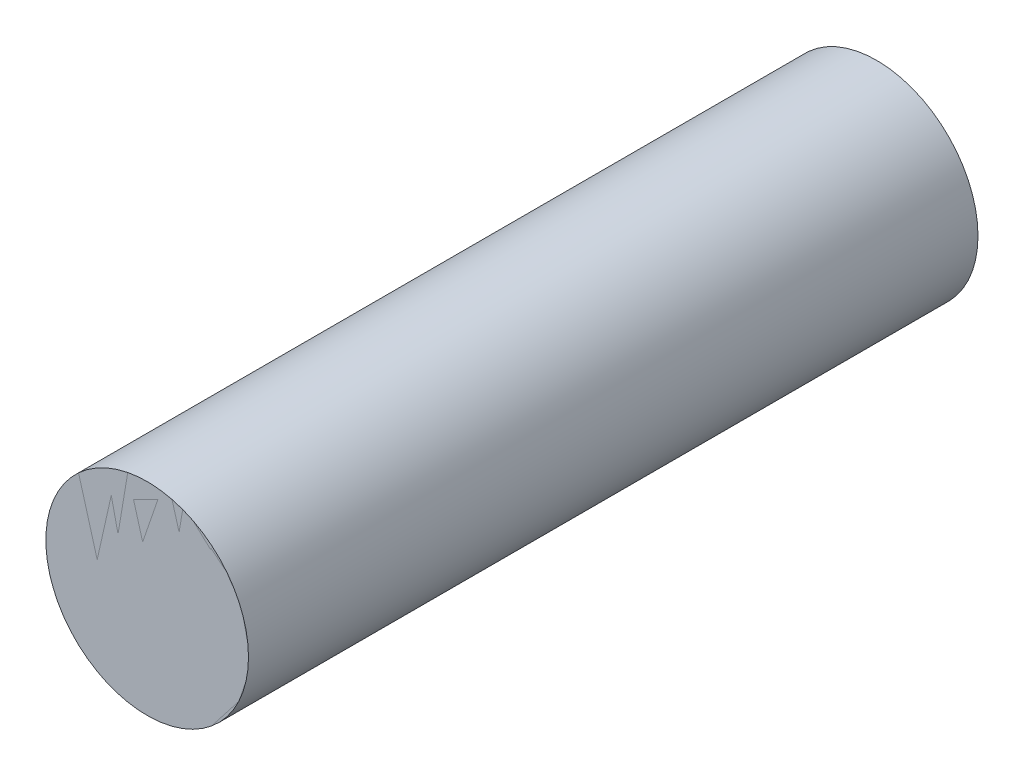
ISO-10303-21;
HEADER;
FILE_DESCRIPTION(('STEP AP214'),'2;1');
FILE_NAME('part.step','',(''),(''),'','','');
FILE_SCHEMA(('AUTOMOTIVE_DESIGN { 1 0 10303 214 1 1 1 1 }'));
ENDSEC;
DATA;
#1=APPLICATION_CONTEXT('core data for automotive mechanical design processes');
#2=APPLICATION_PROTOCOL_DEFINITION('international standard','automotive_design',2000,#1);
#3=PRODUCT_CONTEXT('',#1,'mechanical');
#4=PRODUCT('Part','Part','',(#3));
#5=PRODUCT_RELATED_PRODUCT_CATEGORY('part','',(#4));
#6=PRODUCT_DEFINITION_FORMATION('','',#4);
#7=PRODUCT_DEFINITION_CONTEXT('part definition',#1,'design');
#8=PRODUCT_DEFINITION('design','',#6,#7);
#9=PRODUCT_DEFINITION_SHAPE('','',#8);
#10=(LENGTH_UNIT() NAMED_UNIT(*) SI_UNIT(.MILLI.,.METRE.));
#11=(NAMED_UNIT(*) PLANE_ANGLE_UNIT() SI_UNIT($,.RADIAN.));
#12=(NAMED_UNIT(*) SI_UNIT($,.STERADIAN.) SOLID_ANGLE_UNIT());
#13=UNCERTAINTY_MEASURE_WITH_UNIT(LENGTH_MEASURE(1.E-05),#10,'distance_accuracy_value','');
#14=(GEOMETRIC_REPRESENTATION_CONTEXT(3) GLOBAL_UNCERTAINTY_ASSIGNED_CONTEXT((#13)) GLOBAL_UNIT_ASSIGNED_CONTEXT((#10,
#11,#12)) REPRESENTATION_CONTEXT('',''));
#15=CARTESIAN_POINT('',(0.,0.,0.));
#16=DIRECTION('',(0.,0.,1.));
#17=DIRECTION('',(1.,0.,0.));
#18=AXIS2_PLACEMENT_3D('',#15,#16,#17);
#19=CARTESIAN_POINT('',(-102.183303397109,-56.7521041199526,-7.29999999999987));
#20=DIRECTION('',(0.,0.,1.));
#21=DIRECTION('',(1.,0.,0.));
#22=AXIS2_PLACEMENT_3D('',#19,#20,#21);
#23=CYLINDRICAL_SURFACE('',#22,0.25);
#24=CARTESIAN_POINT('',(-102.183303397109,-56.7521041199526,-7.29999999999987));
#25=DIRECTION('',(0.,0.,1.));
#26=DIRECTION('',(1.,0.,0.));
#27=AXIS2_PLACEMENT_3D('',#24,#25,#26);
#28=CIRCLE('',#27,0.25);
#29=CARTESIAN_POINT('',(-101.933303397109,-56.7521041199526,-7.29999999999987));
#30=VERTEX_POINT('',#29);
#31=EDGE_CURVE('E11',#30,#30,#28,.T.);
#32=ORIENTED_EDGE('',*,*,#31,.T.);
#33=EDGE_LOOP('',(#32));
#34=FACE_BOUND('',#33,.T.);
#35=CARTESIAN_POINT('',(-102.183303397109,-56.7521041199526,-5.49999999999987));
#36=DIRECTION('',(0.,0.,1.));
#37=DIRECTION('',(1.,0.,0.));
#38=AXIS2_PLACEMENT_3D('',#35,#36,#37);
#39=CIRCLE('',#38,0.25);
#40=CARTESIAN_POINT('',(-101.933303397109,-56.7521041199526,-5.49999999999987));
#41=VERTEX_POINT('',#40);
#42=EDGE_CURVE('E46',#41,#41,#39,.T.);
#43=ORIENTED_EDGE('',*,*,#42,.F.);
#44=EDGE_LOOP('',(#43));
#45=FACE_BOUND('',#44,.T.);
#46=ADVANCED_FACE('F43',(#34,#45),#23,.T.);
#47=CARTESIAN_POINT('',(-102.183303397109,-56.7521041199526,-7.29999999999987));
#48=DIRECTION('',(0.,0.,1.));
#49=DIRECTION('',(1.,0.,0.));
#50=AXIS2_PLACEMENT_3D('',#47,#48,#49);
#51=PLANE('',#50);
#52=ORIENTED_EDGE('',*,*,#31,.F.);
#53=EDGE_LOOP('',(#52));
#54=FACE_BOUND('',#53,.T.);
#55=ADVANCED_FACE('F58',(#54),#51,.F.);
#56=CARTESIAN_POINT('',(-102.183303397109,-56.7521041199526,-5.49999999999987));
#57=DIRECTION('',(0.,0.,1.));
#58=DIRECTION('',(1.,0.,0.));
#59=AXIS2_PLACEMENT_3D('',#56,#57,#58);
#60=PLANE('',#59);
#61=ORIENTED_EDGE('',*,*,#42,.T.);
#62=EDGE_LOOP('',(#61));
#63=FACE_BOUND('',#62,.T.);
#64=ADVANCED_FACE('F55',(#63),#60,.T.);
#65=CLOSED_SHELL('',(#46,#55,#64));
#66=MANIFOLD_SOLID_BREP('B2',#65);
#67=CARTESIAN_POINT('',(-102.183303397109,-56.7521041199526,-5.49999999999986));
#68=DIRECTION('',(0.,0.,-1.));
#69=DIRECTION('',(-1.,0.,0.));
#70=AXIS2_PLACEMENT_3D('',#67,#68,#69);
#71=PLANE('',#70);
#72=CARTESIAN_POINT('',(-102.183303397109,-56.7521041199526,-5.49999999999986));
#73=DIRECTION('',(0.,0.,1.));
#74=DIRECTION('',(1.,0.,0.));
#75=AXIS2_PLACEMENT_3D('',#72,#73,#74);
#76=CIRCLE('',#75,0.25);
#77=CARTESIAN_POINT('',(-101.933303397109,-56.7521041199526,-5.49999999999986));
#78=VERTEX_POINT('',#77);
#79=EDGE_CURVE('E42',#78,#78,#76,.F.);
#80=ORIENTED_EDGE('',*,*,#79,.F.);
#81=EDGE_LOOP('',(#80));
#82=FACE_BOUND('',#81,.T.);
#83=ADVANCED_FACE('F83',(#82),#71,.F.);
#84=OPEN_SHELL('',(#83));
#85=SHELL_BASED_SURFACE_MODEL('B6',(#84));
#86=ADVANCED_BREP_SHAPE_REPRESENTATION('',(#18,#66),#14);
#87=MANIFOLD_SURFACE_SHAPE_REPRESENTATION('',(#18,#85),#14);
#88=SHAPE_REPRESENTATION('',(#18),#14);
#89=SHAPE_DEFINITION_REPRESENTATION(#9,#88);
#90=SHAPE_REPRESENTATION_RELATIONSHIP('','',#88,#86);
#91=SHAPE_REPRESENTATION_RELATIONSHIP('','',#88,#87);
ENDSEC;
END-ISO-10303-21;
